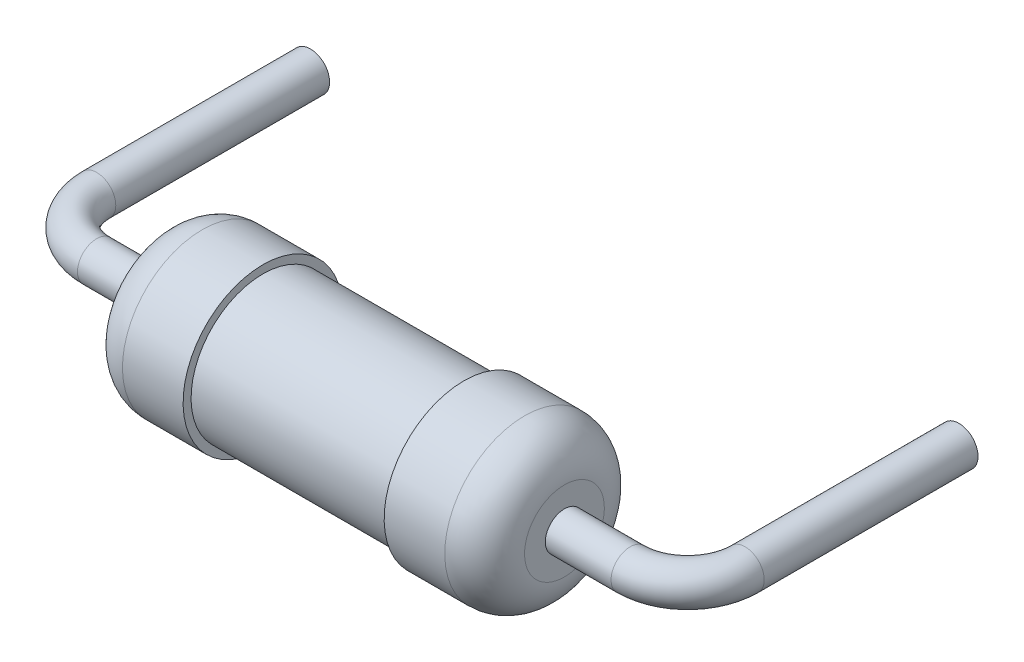
ISO-10303-21;
HEADER;
FILE_DESCRIPTION(('STEP AP214'),'2;1');
FILE_NAME('part.step','',(''),(''),'','','');
FILE_SCHEMA(('AUTOMOTIVE_DESIGN { 1 0 10303 214 1 1 1 1 }'));
ENDSEC;
DATA;
#1=APPLICATION_CONTEXT('core data for automotive mechanical design processes');
#2=APPLICATION_PROTOCOL_DEFINITION('international standard','automotive_design',2000,#1);
#3=PRODUCT_CONTEXT('',#1,'mechanical');
#4=PRODUCT('Part','Part','',(#3));
#5=PRODUCT_RELATED_PRODUCT_CATEGORY('part','',(#4));
#6=PRODUCT_DEFINITION_FORMATION('','',#4);
#7=PRODUCT_DEFINITION_CONTEXT('part definition',#1,'design');
#8=PRODUCT_DEFINITION('design','',#6,#7);
#9=PRODUCT_DEFINITION_SHAPE('','',#8);
#10=(LENGTH_UNIT() NAMED_UNIT(*) SI_UNIT(.MILLI.,.METRE.));
#11=(NAMED_UNIT(*) PLANE_ANGLE_UNIT() SI_UNIT($,.RADIAN.));
#12=(NAMED_UNIT(*) SI_UNIT($,.STERADIAN.) SOLID_ANGLE_UNIT());
#13=UNCERTAINTY_MEASURE_WITH_UNIT(LENGTH_MEASURE(1.E-05),#10,'distance_accuracy_value','');
#14=(GEOMETRIC_REPRESENTATION_CONTEXT(3) GLOBAL_UNCERTAINTY_ASSIGNED_CONTEXT((#13)) GLOBAL_UNIT_ASSIGNED_CONTEXT((#10,
#11,#12)) REPRESENTATION_CONTEXT('',''));
#15=CARTESIAN_POINT('',(0.,0.,0.));
#16=DIRECTION('',(0.,0.,1.));
#17=DIRECTION('',(1.,0.,0.));
#18=AXIS2_PLACEMENT_3D('',#15,#16,#17);
#19=CARTESIAN_POINT('',(9.86,0.,-3.));
#20=DIRECTION('',(0.,0.,1.));
#21=DIRECTION('',(1.,0.,0.));
#22=AXIS2_PLACEMENT_3D('',#19,#20,#21);
#23=PLANE('',#22);
#24=CARTESIAN_POINT('',(10.16,0.,-3.));
#25=DIRECTION('',(0.,0.,-1.));
#26=DIRECTION('',(-1.,0.,0.));
#27=AXIS2_PLACEMENT_3D('',#24,#25,#26);
#28=CIRCLE('',#27,0.3);
#29=CARTESIAN_POINT('',(9.86,0.,-3.));
#30=VERTEX_POINT('',#29);
#31=EDGE_CURVE('E11',#30,#30,#28,.T.);
#32=ORIENTED_EDGE('',*,*,#31,.T.);
#33=EDGE_LOOP('',(#32));
#34=FACE_BOUND('',#33,.T.);
#35=ADVANCED_FACE('F17',(#34),#23,.F.);
#36=CARTESIAN_POINT('',(10.16,0.,0.35));
#37=DIRECTION('',(0.,0.,-1.));
#38=DIRECTION('',(-1.,0.,0.));
#39=AXIS2_PLACEMENT_3D('',#36,#37,#38);
#40=CYLINDRICAL_SURFACE('',#39,0.3);
#41=DIRECTION('',(0.,0.,-1.));
#42=VECTOR('',#41,1.);
#43=CARTESIAN_POINT('',(9.86,0.,0.35));
#44=LINE('',#43,#42);
#45=CARTESIAN_POINT('',(9.86,0.,0.35));
#46=VERTEX_POINT('',#45);
#47=EDGE_CURVE('E26',#46,#30,#44,.T.);
#48=ORIENTED_EDGE('',*,*,#47,.T.);
#49=ORIENTED_EDGE('',*,*,#31,.F.);
#50=ORIENTED_EDGE('',*,*,#47,.F.);
#51=CARTESIAN_POINT('',(10.16,0.,0.35));
#52=DIRECTION('',(0.,0.,1.));
#53=DIRECTION('',(1.,0.,0.));
#54=AXIS2_PLACEMENT_3D('',#51,#52,#53);
#55=CIRCLE('',#54,0.3);
#56=EDGE_CURVE('E136',#46,#46,#55,.T.);
#57=ORIENTED_EDGE('',*,*,#56,.F.);
#58=EDGE_LOOP('',(#48,#49,#50,#57));
#59=FACE_BOUND('',#58,.T.);
#60=ADVANCED_FACE('F19',(#59),#40,.T.);
#61=CARTESIAN_POINT('',(9.26,0.,0.35));
#62=DIRECTION('',(0.,1.,0.));
#63=DIRECTION('',(0.,0.,1.));
#64=AXIS2_PLACEMENT_3D('',#61,#62,#63);
#65=TOROIDAL_SURFACE('',#64,0.9,0.3);
#66=CARTESIAN_POINT('',(9.26,0.,0.35));
#67=DIRECTION('',(0.,1.,0.));
#68=DIRECTION('',(0.,0.,1.));
#69=AXIS2_PLACEMENT_3D('',#66,#67,#68);
#70=CIRCLE('',#69,0.6);
#71=CARTESIAN_POINT('',(9.26,0.,0.95));
#72=VERTEX_POINT('',#71);
#73=EDGE_CURVE('E133',#72,#46,#70,.T.);
#74=ORIENTED_EDGE('',*,*,#73,.T.);
#75=ORIENTED_EDGE('',*,*,#56,.T.);
#76=ORIENTED_EDGE('',*,*,#73,.F.);
#77=CARTESIAN_POINT('',(9.26,0.,1.25));
#78=DIRECTION('',(1.,0.,0.));
#79=DIRECTION('',(0.,0.,-1.));
#80=AXIS2_PLACEMENT_3D('',#77,#78,#79);
#81=CIRCLE('',#80,0.3);
#82=EDGE_CURVE('E129',#72,#72,#81,.T.);
#83=ORIENTED_EDGE('',*,*,#82,.T.);
#84=EDGE_LOOP('',(#74,#75,#76,#83));
#85=FACE_BOUND('',#84,.T.);
#86=ADVANCED_FACE('F259',(#85),#65,.T.);
#87=CARTESIAN_POINT('',(0.9,0.,1.25));
#88=DIRECTION('',(1.,0.,0.));
#89=DIRECTION('',(0.,0.,-1.));
#90=AXIS2_PLACEMENT_3D('',#87,#88,#89);
#91=CYLINDRICAL_SURFACE('',#90,0.3);
#92=CARTESIAN_POINT('',(8.23,0.,1.25));
#93=DIRECTION('',(1.,0.,0.));
#94=DIRECTION('',(0.,0.,-1.));
#95=AXIS2_PLACEMENT_3D('',#92,#93,#94);
#96=CIRCLE('',#95,0.3);
#97=CARTESIAN_POINT('',(8.23,0.,0.95));
#98=VERTEX_POINT('',#97);
#99=EDGE_CURVE('E119',#98,#98,#96,.T.);
#100=ORIENTED_EDGE('',*,*,#99,.T.);
#101=DIRECTION('',(1.,0.,0.));
#102=VECTOR('',#101,1.);
#103=CARTESIAN_POINT('',(0.9,0.,0.95));
#104=LINE('',#103,#102);
#105=EDGE_CURVE('E92',#98,#72,#104,.T.);
#106=ORIENTED_EDGE('',*,*,#105,.T.);
#107=ORIENTED_EDGE('',*,*,#82,.F.);
#108=ORIENTED_EDGE('',*,*,#105,.F.);
#109=EDGE_LOOP('',(#100,#106,#107,#108));
#110=FACE_BOUND('',#109,.T.);
#111=ADVANCED_FACE('F370',(#110),#91,.T.);
#112=CARTESIAN_POINT('',(8.23,1.25,1.25));
#113=DIRECTION('',(-1.,0.,0.));
#114=DIRECTION('',(0.,0.,1.));
#115=AXIS2_PLACEMENT_3D('',#112,#113,#114);
#116=PLANE('',#115);
#117=ORIENTED_EDGE('',*,*,#99,.F.);
#118=EDGE_LOOP('',(#117));
#119=FACE_BOUND('',#118,.T.);
#120=CARTESIAN_POINT('',(8.23,0.,1.25));
#121=DIRECTION('',(1.,0.,0.));
#122=DIRECTION('',(0.,1.,0.));
#123=AXIS2_PLACEMENT_3D('',#120,#121,#122);
#124=CIRCLE('',#123,0.625);
#125=CARTESIAN_POINT('',(8.23,0.625,1.25));
#126=VERTEX_POINT('',#125);
#127=EDGE_CURVE('E101',#126,#126,#124,.T.);
#128=ORIENTED_EDGE('',*,*,#127,.T.);
#129=EDGE_LOOP('',(#128));
#130=FACE_BOUND('',#129,.T.);
#131=ADVANCED_FACE('F398',(#119,#130),#116,.F.);
#132=CARTESIAN_POINT('',(0.3,0.,-3.));
#133=DIRECTION('',(0.,0.,-1.));
#134=DIRECTION('',(0.,-1.,0.));
#135=AXIS2_PLACEMENT_3D('',#132,#133,#134);
#136=PLANE('',#135);
#137=CARTESIAN_POINT('',(0.,0.,-3.));
#138=DIRECTION('',(0.,0.,1.));
#139=DIRECTION('',(1.,0.,0.));
#140=AXIS2_PLACEMENT_3D('',#137,#138,#139);
#141=CIRCLE('',#140,0.3);
#142=CARTESIAN_POINT('',(0.3,0.,-3.));
#143=VERTEX_POINT('',#142);
#144=EDGE_CURVE('E114',#143,#143,#141,.T.);
#145=ORIENTED_EDGE('',*,*,#144,.F.);
#146=EDGE_LOOP('',(#145));
#147=FACE_BOUND('',#146,.T.);
#148=ADVANCED_FACE('F390',(#147),#136,.T.);
#149=CARTESIAN_POINT('',(7.605,0.,1.25));
#150=DIRECTION('',(1.,0.,0.));
#151=DIRECTION('',(0.,1.,0.));
#152=AXIS2_PLACEMENT_3D('',#149,#150,#151);
#153=DEGENERATE_TOROIDAL_SURFACE('',#152,0.625,0.625,.T.);
#154=CARTESIAN_POINT('',(7.605,0.625,1.25));
#155=DIRECTION('',(0.,0.,-1.));
#156=DIRECTION('',(0.,1.,0.));
#157=AXIS2_PLACEMENT_3D('',#154,#155,#156);
#158=CIRCLE('',#157,0.625);
#159=CARTESIAN_POINT('',(7.605,1.25,1.25));
#160=VERTEX_POINT('',#159);
#161=EDGE_CURVE('E109',#160,#126,#158,.T.);
#162=ORIENTED_EDGE('',*,*,#161,.F.);
#163=CARTESIAN_POINT('',(7.605,0.,1.25));
#164=DIRECTION('',(1.,0.,0.));
#165=DIRECTION('',(0.,1.,0.));
#166=AXIS2_PLACEMENT_3D('',#163,#164,#165);
#167=CIRCLE('',#166,1.25);
#168=EDGE_CURVE('E112',#160,#160,#167,.T.);
#169=ORIENTED_EDGE('',*,*,#168,.T.);
#170=ORIENTED_EDGE('',*,*,#161,.T.);
#171=ORIENTED_EDGE('',*,*,#127,.F.);
#172=EDGE_LOOP('',(#162,#169,#170,#171));
#173=FACE_BOUND('',#172,.T.);
#174=ADVANCED_FACE('F110',(#173),#153,.T.);
#175=CARTESIAN_POINT('',(0.,0.,-3.));
#176=DIRECTION('',(0.,0.,1.));
#177=DIRECTION('',(1.,0.,0.));
#178=AXIS2_PLACEMENT_3D('',#175,#176,#177);
#179=CYLINDRICAL_SURFACE('',#178,0.3);
#180=DIRECTION('',(0.,0.,1.));
#181=VECTOR('',#180,1.);
#182=CARTESIAN_POINT('',(0.3,0.,-3.));
#183=LINE('',#182,#181);
#184=CARTESIAN_POINT('',(0.3,0.,0.35));
#185=VERTEX_POINT('',#184);
#186=EDGE_CURVE('E121',#143,#185,#183,.T.);
#187=ORIENTED_EDGE('',*,*,#186,.T.);
#188=CARTESIAN_POINT('',(0.,0.,0.35));
#189=DIRECTION('',(0.,0.,1.));
#190=DIRECTION('',(1.,0.,0.));
#191=AXIS2_PLACEMENT_3D('',#188,#189,#190);
#192=CIRCLE('',#191,0.3);
#193=EDGE_CURVE('E182',#185,#185,#192,.T.);
#194=ORIENTED_EDGE('',*,*,#193,.F.);
#195=ORIENTED_EDGE('',*,*,#186,.F.);
#196=ORIENTED_EDGE('',*,*,#144,.T.);
#197=EDGE_LOOP('',(#187,#194,#195,#196));
#198=FACE_BOUND('',#197,.T.);
#199=ADVANCED_FACE('F203',(#198),#179,.T.);
#200=CARTESIAN_POINT('',(6.655,0.,1.25));
#201=DIRECTION('',(-1.,0.,0.));
#202=DIRECTION('',(0.,1.,0.));
#203=AXIS2_PLACEMENT_3D('',#200,#201,#202);
#204=CYLINDRICAL_SURFACE('',#203,1.25);
#205=CARTESIAN_POINT('',(6.655,0.,1.25));
#206=DIRECTION('',(1.,0.,0.));
#207=DIRECTION('',(0.,1.,0.));
#208=AXIS2_PLACEMENT_3D('',#205,#206,#207);
#209=CIRCLE('',#208,1.25);
#210=CARTESIAN_POINT('',(6.655,1.25,1.25));
#211=VERTEX_POINT('',#210);
#212=EDGE_CURVE('E190',#211,#211,#209,.T.);
#213=ORIENTED_EDGE('',*,*,#212,.T.);
#214=DIRECTION('',(1.,0.,0.));
#215=VECTOR('',#214,1.);
#216=CARTESIAN_POINT('',(6.655,1.25,1.25));
#217=LINE('',#216,#215);
#218=EDGE_CURVE('E178',#211,#160,#217,.T.);
#219=ORIENTED_EDGE('',*,*,#218,.T.);
#220=ORIENTED_EDGE('',*,*,#168,.F.);
#221=ORIENTED_EDGE('',*,*,#218,.F.);
#222=EDGE_LOOP('',(#213,#219,#220,#221));
#223=FACE_BOUND('',#222,.T.);
#224=ADVANCED_FACE('F236',(#223),#204,.T.);
#225=CARTESIAN_POINT('',(0.9,0.,0.35));
#226=DIRECTION('',(0.,1.,0.));
#227=DIRECTION('',(-1.,0.,0.));
#228=AXIS2_PLACEMENT_3D('',#225,#226,#227);
#229=TOROIDAL_SURFACE('',#228,0.9,0.3);
#230=CARTESIAN_POINT('',(0.9,0.,0.35));
#231=DIRECTION('',(0.,1.,0.));
#232=DIRECTION('',(-1.,0.,0.));
#233=AXIS2_PLACEMENT_3D('',#230,#231,#232);
#234=CIRCLE('',#233,0.6);
#235=CARTESIAN_POINT('',(0.9,0.,0.95));
#236=VERTEX_POINT('',#235);
#237=EDGE_CURVE('E191',#185,#236,#234,.T.);
#238=ORIENTED_EDGE('',*,*,#237,.T.);
#239=CARTESIAN_POINT('',(0.9,0.,1.25));
#240=DIRECTION('',(-1.,0.,0.));
#241=DIRECTION('',(0.,0.,1.));
#242=AXIS2_PLACEMENT_3D('',#239,#240,#241);
#243=CIRCLE('',#242,0.3);
#244=EDGE_CURVE('E153',#236,#236,#243,.T.);
#245=ORIENTED_EDGE('',*,*,#244,.T.);
#246=ORIENTED_EDGE('',*,*,#237,.F.);
#247=ORIENTED_EDGE('',*,*,#193,.T.);
#248=EDGE_LOOP('',(#238,#245,#246,#247));
#249=FACE_BOUND('',#248,.T.);
#250=ADVANCED_FACE('F207',(#249),#229,.T.);
#251=CARTESIAN_POINT('',(6.655,1.25,1.25));
#252=DIRECTION('',(-1.,0.,0.));
#253=DIRECTION('',(0.,0.,1.));
#254=AXIS2_PLACEMENT_3D('',#251,#252,#253);
#255=PLANE('',#254);
#256=CARTESIAN_POINT('',(6.655,0.,1.25));
#257=DIRECTION('',(-1.,0.,0.));
#258=DIRECTION('',(0.,1.,0.));
#259=AXIS2_PLACEMENT_3D('',#256,#257,#258);
#260=CIRCLE('',#259,1.125);
#261=CARTESIAN_POINT('',(6.655,1.125,1.25));
#262=VERTEX_POINT('',#261);
#263=EDGE_CURVE('E177',#262,#262,#260,.T.);
#264=ORIENTED_EDGE('',*,*,#263,.F.);
#265=EDGE_LOOP('',(#264));
#266=FACE_BOUND('',#265,.T.);
#267=ORIENTED_EDGE('',*,*,#212,.F.);
#268=EDGE_LOOP('',(#267));
#269=FACE_BOUND('',#268,.T.);
#270=ADVANCED_FACE('F238',(#266,#269),#255,.T.);
#271=CARTESIAN_POINT('',(0.9,0.,1.25));
#272=DIRECTION('',(1.,0.,0.));
#273=DIRECTION('',(0.,0.,-1.));
#274=AXIS2_PLACEMENT_3D('',#271,#272,#273);
#275=CYLINDRICAL_SURFACE('',#274,0.3);
#276=ORIENTED_EDGE('',*,*,#244,.F.);
#277=DIRECTION('',(1.,0.,0.));
#278=VECTOR('',#277,1.);
#279=CARTESIAN_POINT('',(0.9,0.,0.95));
#280=LINE('',#279,#278);
#281=CARTESIAN_POINT('',(1.93,0.,0.95));
#282=VERTEX_POINT('',#281);
#283=EDGE_CURVE('E157',#236,#282,#280,.T.);
#284=ORIENTED_EDGE('',*,*,#283,.T.);
#285=CARTESIAN_POINT('',(1.93,0.,1.25));
#286=DIRECTION('',(1.,0.,0.));
#287=DIRECTION('',(0.,0.,-1.));
#288=AXIS2_PLACEMENT_3D('',#285,#286,#287);
#289=CIRCLE('',#288,0.3);
#290=EDGE_CURVE('E173',#282,#282,#289,.T.);
#291=ORIENTED_EDGE('',*,*,#290,.F.);
#292=ORIENTED_EDGE('',*,*,#283,.F.);
#293=EDGE_LOOP('',(#276,#284,#291,#292));
#294=FACE_BOUND('',#293,.T.);
#295=ADVANCED_FACE('F211',(#294),#275,.T.);
#296=CARTESIAN_POINT('',(1.93,0.,1.25));
#297=DIRECTION('',(-1.,0.,0.));
#298=DIRECTION('',(0.,1.,0.));
#299=AXIS2_PLACEMENT_3D('',#296,#297,#298);
#300=CYLINDRICAL_SURFACE('',#299,1.125);
#301=ORIENTED_EDGE('',*,*,#263,.T.);
#302=DIRECTION('',(1.,0.,0.));
#303=VECTOR('',#302,1.);
#304=CARTESIAN_POINT('',(1.93,1.125,1.25));
#305=LINE('',#304,#303);
#306=CARTESIAN_POINT('',(3.505,1.125,1.25));
#307=VERTEX_POINT('',#306);
#308=EDGE_CURVE('E158',#307,#262,#305,.T.);
#309=ORIENTED_EDGE('',*,*,#308,.F.);
#310=CARTESIAN_POINT('',(3.505,0.,1.25));
#311=DIRECTION('',(-1.,0.,0.));
#312=DIRECTION('',(0.,1.,0.));
#313=AXIS2_PLACEMENT_3D('',#310,#311,#312);
#314=CIRCLE('',#313,1.125);
#315=EDGE_CURVE('E169',#307,#307,#314,.T.);
#316=ORIENTED_EDGE('',*,*,#315,.F.);
#317=ORIENTED_EDGE('',*,*,#308,.T.);
#318=EDGE_LOOP('',(#301,#309,#316,#317));
#319=FACE_BOUND('',#318,.T.);
#320=ADVANCED_FACE('F218',(#319),#300,.T.);
#321=CARTESIAN_POINT('',(1.93,1.25,1.25));
#322=DIRECTION('',(-1.,0.,0.));
#323=DIRECTION('',(0.,0.,1.));
#324=AXIS2_PLACEMENT_3D('',#321,#322,#323);
#325=PLANE('',#324);
#326=ORIENTED_EDGE('',*,*,#290,.T.);
#327=EDGE_LOOP('',(#326));
#328=FACE_BOUND('',#327,.T.);
#329=CARTESIAN_POINT('',(1.93,0.,1.25));
#330=DIRECTION('',(1.,0.,0.));
#331=DIRECTION('',(0.,1.,0.));
#332=AXIS2_PLACEMENT_3D('',#329,#330,#331);
#333=CIRCLE('',#332,0.625);
#334=CARTESIAN_POINT('',(1.93,0.625,1.25));
#335=VERTEX_POINT('',#334);
#336=EDGE_CURVE('E162',#335,#335,#333,.T.);
#337=ORIENTED_EDGE('',*,*,#336,.F.);
#338=EDGE_LOOP('',(#337));
#339=FACE_BOUND('',#338,.T.);
#340=ADVANCED_FACE('F214',(#328,#339),#325,.T.);
#341=CARTESIAN_POINT('',(3.505,1.25,1.25));
#342=DIRECTION('',(-1.,0.,0.));
#343=DIRECTION('',(0.,0.,1.));
#344=AXIS2_PLACEMENT_3D('',#341,#342,#343);
#345=PLANE('',#344);
#346=ORIENTED_EDGE('',*,*,#315,.T.);
#347=EDGE_LOOP('',(#346));
#348=FACE_BOUND('',#347,.T.);
#349=CARTESIAN_POINT('',(3.505,0.,1.25));
#350=DIRECTION('',(1.,0.,0.));
#351=DIRECTION('',(0.,1.,0.));
#352=AXIS2_PLACEMENT_3D('',#349,#350,#351);
#353=CIRCLE('',#352,1.25);
#354=CARTESIAN_POINT('',(3.505,1.25,1.25));
#355=VERTEX_POINT('',#354);
#356=EDGE_CURVE('E152',#355,#355,#353,.T.);
#357=ORIENTED_EDGE('',*,*,#356,.T.);
#358=EDGE_LOOP('',(#357));
#359=FACE_BOUND('',#358,.T.);
#360=ADVANCED_FACE('F217',(#348,#359),#345,.F.);
#361=CARTESIAN_POINT('',(2.555,0.,1.25));
#362=DIRECTION('',(-1.,0.,0.));
#363=DIRECTION('',(0.,1.,0.));
#364=AXIS2_PLACEMENT_3D('',#361,#362,#363);
#365=DEGENERATE_TOROIDAL_SURFACE('',#364,0.625,0.625,.T.);
#366=ORIENTED_EDGE('',*,*,#336,.T.);
#367=CARTESIAN_POINT('',(2.555,0.625,1.25));
#368=DIRECTION('',(0.,0.,1.));
#369=DIRECTION('',(0.,1.,0.));
#370=AXIS2_PLACEMENT_3D('',#367,#368,#369);
#371=CIRCLE('',#370,0.625);
#372=CARTESIAN_POINT('',(2.555,1.25,1.25));
#373=VERTEX_POINT('',#372);
#374=EDGE_CURVE('E166',#373,#335,#371,.T.);
#375=ORIENTED_EDGE('',*,*,#374,.F.);
#376=CARTESIAN_POINT('',(2.555,0.,1.25));
#377=DIRECTION('',(1.,0.,0.));
#378=DIRECTION('',(0.,1.,0.));
#379=AXIS2_PLACEMENT_3D('',#376,#377,#378);
#380=CIRCLE('',#379,1.25);
#381=EDGE_CURVE('E147',#373,#373,#380,.T.);
#382=ORIENTED_EDGE('',*,*,#381,.F.);
#383=ORIENTED_EDGE('',*,*,#374,.T.);
#384=EDGE_LOOP('',(#366,#375,#382,#383));
#385=FACE_BOUND('',#384,.T.);
#386=ADVANCED_FACE('F223',(#385),#365,.T.);
#387=CARTESIAN_POINT('',(1.93,0.,1.25));
#388=DIRECTION('',(-1.,0.,0.));
#389=DIRECTION('',(0.,1.,0.));
#390=AXIS2_PLACEMENT_3D('',#387,#388,#389);
#391=CYLINDRICAL_SURFACE('',#390,1.25);
#392=ORIENTED_EDGE('',*,*,#381,.T.);
#393=DIRECTION('',(1.,0.,0.));
#394=VECTOR('',#393,1.);
#395=CARTESIAN_POINT('',(1.93,1.25,1.25));
#396=LINE('',#395,#394);
#397=EDGE_CURVE('E149',#373,#355,#396,.T.);
#398=ORIENTED_EDGE('',*,*,#397,.T.);
#399=ORIENTED_EDGE('',*,*,#356,.F.);
#400=ORIENTED_EDGE('',*,*,#397,.F.);
#401=EDGE_LOOP('',(#392,#398,#399,#400));
#402=FACE_BOUND('',#401,.T.);
#403=ADVANCED_FACE('F264',(#402),#391,.T.);
#404=CLOSED_SHELL('',(#35,#60,#86,#111,#131,#148,#174,#199,#224,#250,#270,#295,#320,#340,#360,
#386,#403));
#405=MANIFOLD_SOLID_BREP('B1',#404);
#406=ADVANCED_BREP_SHAPE_REPRESENTATION('',(#18,#405),#14);
#407=SHAPE_DEFINITION_REPRESENTATION(#9,#406);
ENDSEC;
END-ISO-10303-21;
